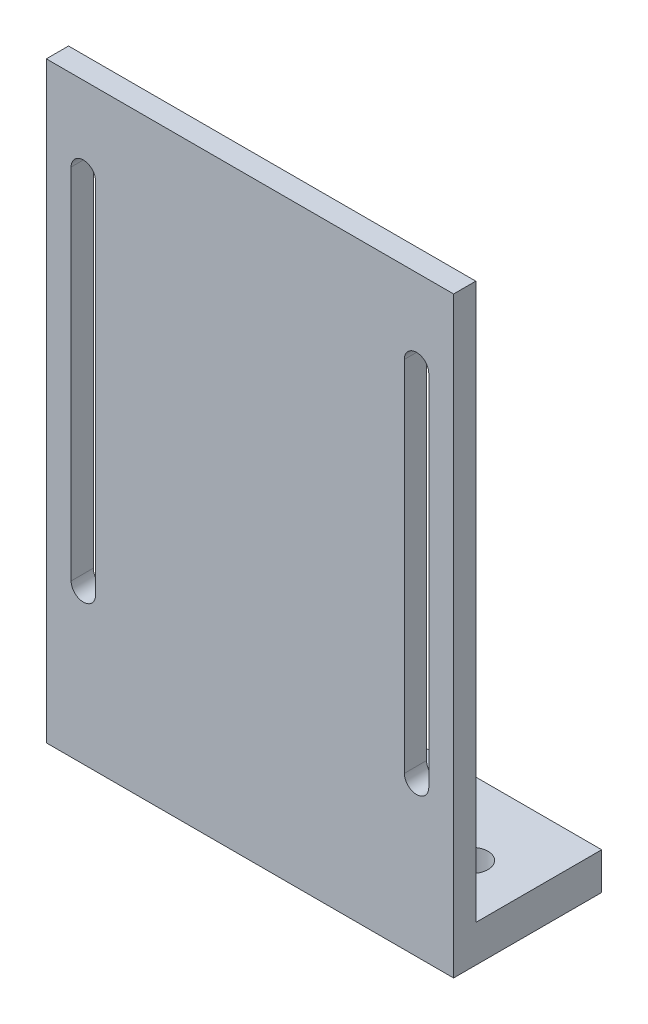
ISO-10303-21;
HEADER;
FILE_DESCRIPTION(('STEP AP214'),'2;1');
FILE_NAME('part.step','',(''),(''),'','','');
FILE_SCHEMA(('AUTOMOTIVE_DESIGN { 1 0 10303 214 1 1 1 1 }'));
ENDSEC;
DATA;
#1=APPLICATION_CONTEXT('core data for automotive mechanical design processes');
#2=APPLICATION_PROTOCOL_DEFINITION('international standard','automotive_design',2000,#1);
#3=PRODUCT_CONTEXT('',#1,'mechanical');
#4=PRODUCT('Part','Part','',(#3));
#5=PRODUCT_RELATED_PRODUCT_CATEGORY('part','',(#4));
#6=PRODUCT_DEFINITION_FORMATION('','',#4);
#7=PRODUCT_DEFINITION_CONTEXT('part definition',#1,'design');
#8=PRODUCT_DEFINITION('design','',#6,#7);
#9=PRODUCT_DEFINITION_SHAPE('','',#8);
#10=(LENGTH_UNIT() NAMED_UNIT(*) SI_UNIT(.MILLI.,.METRE.));
#11=(NAMED_UNIT(*) PLANE_ANGLE_UNIT() SI_UNIT($,.RADIAN.));
#12=(NAMED_UNIT(*) SI_UNIT($,.STERADIAN.) SOLID_ANGLE_UNIT());
#13=UNCERTAINTY_MEASURE_WITH_UNIT(LENGTH_MEASURE(1.E-05),#10,'distance_accuracy_value','');
#14=(GEOMETRIC_REPRESENTATION_CONTEXT(3) GLOBAL_UNCERTAINTY_ASSIGNED_CONTEXT((#13)) GLOBAL_UNIT_ASSIGNED_CONTEXT((#10,
#11,#12)) REPRESENTATION_CONTEXT('',''));
#15=CARTESIAN_POINT('',(0.,0.,0.));
#16=DIRECTION('',(0.,0.,1.));
#17=DIRECTION('',(1.,0.,0.));
#18=AXIS2_PLACEMENT_3D('',#15,#16,#17);
#19=CARTESIAN_POINT('',(0.,5.,0.));
#20=DIRECTION('',(0.,1.,0.));
#21=DIRECTION('',(0.,0.,1.));
#22=AXIS2_PLACEMENT_3D('',#19,#20,#21);
#23=PLANE('',#22);
#24=DIRECTION('',(-1.,0.,0.));
#25=VECTOR('',#24,1.);
#26=CARTESIAN_POINT('',(-27.5,5.,6.99999999999999));
#27=LINE('',#26,#25);
#28=CARTESIAN_POINT('',(27.5,5.,6.99999999999999));
#29=VERTEX_POINT('',#28);
#30=CARTESIAN_POINT('',(-27.5,5.,6.99999999999999));
#31=VERTEX_POINT('',#30);
#32=EDGE_CURVE('E203',#29,#31,#27,.T.);
#33=ORIENTED_EDGE('',*,*,#32,.F.);
#34=DIRECTION('',(0.,0.,-1.));
#35=VECTOR('',#34,1.);
#36=CARTESIAN_POINT('',(27.5,5.,-9.99999999999999));
#37=LINE('',#36,#35);
#38=CARTESIAN_POINT('',(27.5,5.,-9.99999999999999));
#39=VERTEX_POINT('',#38);
#40=EDGE_CURVE('E235',#29,#39,#37,.T.);
#41=ORIENTED_EDGE('',*,*,#40,.T.);
#42=DIRECTION('',(-1.,0.,0.));
#43=VECTOR('',#42,1.);
#44=CARTESIAN_POINT('',(-27.5,5.,-10.));
#45=LINE('',#44,#43);
#46=CARTESIAN_POINT('',(-27.5,5.,-10.));
#47=VERTEX_POINT('',#46);
#48=EDGE_CURVE('E237',#39,#47,#45,.T.);
#49=ORIENTED_EDGE('',*,*,#48,.T.);
#50=DIRECTION('',(0.,0.,1.));
#51=VECTOR('',#50,1.);
#52=CARTESIAN_POINT('',(-27.5,5.,-10.));
#53=LINE('',#52,#51);
#54=EDGE_CURVE('E240',#47,#31,#53,.T.);
#55=ORIENTED_EDGE('',*,*,#54,.T.);
#56=EDGE_LOOP('',(#33,#41,#49,#55));
#57=FACE_BOUND('',#56,.T.);
#58=CARTESIAN_POINT('',(-20.,5.,0.));
#59=DIRECTION('',(0.,1.,0.));
#60=DIRECTION('',(0.,0.,1.));
#61=AXIS2_PLACEMENT_3D('',#58,#59,#60);
#62=CIRCLE('',#61,2.15);
#63=CARTESIAN_POINT('',(-20.,5.,2.15));
#64=VERTEX_POINT('',#63);
#65=EDGE_CURVE('E229',#64,#64,#62,.T.);
#66=ORIENTED_EDGE('',*,*,#65,.F.);
#67=EDGE_LOOP('',(#66));
#68=FACE_BOUND('',#67,.T.);
#69=CARTESIAN_POINT('',(20.,5.,0.));
#70=DIRECTION('',(0.,1.,0.));
#71=DIRECTION('',(0.,0.,1.));
#72=AXIS2_PLACEMENT_3D('',#69,#70,#71);
#73=CIRCLE('',#72,2.15);
#74=CARTESIAN_POINT('',(20.,5.,2.15));
#75=VERTEX_POINT('',#74);
#76=EDGE_CURVE('E223',#75,#75,#73,.T.);
#77=ORIENTED_EDGE('',*,*,#76,.F.);
#78=EDGE_LOOP('',(#77));
#79=FACE_BOUND('',#78,.T.);
#80=ADVANCED_FACE('F33',(#57,#68,#79),#23,.T.);
#81=CARTESIAN_POINT('',(0.,0.,0.));
#82=DIRECTION('',(0.,1.,0.));
#83=DIRECTION('',(0.,0.,1.));
#84=AXIS2_PLACEMENT_3D('',#81,#82,#83);
#85=PLANE('',#84);
#86=DIRECTION('',(0.,0.,-1.));
#87=VECTOR('',#86,1.);
#88=CARTESIAN_POINT('',(27.5,0.,-9.99999999999999));
#89=LINE('',#88,#87);
#90=CARTESIAN_POINT('',(27.5,0.,9.99999999999999));
#91=VERTEX_POINT('',#90);
#92=CARTESIAN_POINT('',(27.5,0.,-9.99999999999999));
#93=VERTEX_POINT('',#92);
#94=EDGE_CURVE('E232',#91,#93,#89,.T.);
#95=ORIENTED_EDGE('',*,*,#94,.F.);
#96=DIRECTION('',(1.,0.,0.));
#97=VECTOR('',#96,1.);
#98=CARTESIAN_POINT('',(-27.5,0.,9.99999999999999));
#99=LINE('',#98,#97);
#100=CARTESIAN_POINT('',(-27.5,0.,9.99999999999999));
#101=VERTEX_POINT('',#100);
#102=EDGE_CURVE('E238',#101,#91,#99,.T.);
#103=ORIENTED_EDGE('',*,*,#102,.F.);
#104=DIRECTION('',(0.,0.,1.));
#105=VECTOR('',#104,1.);
#106=CARTESIAN_POINT('',(-27.5,0.,-10.));
#107=LINE('',#106,#105);
#108=CARTESIAN_POINT('',(-27.5,0.,-10.));
#109=VERTEX_POINT('',#108);
#110=EDGE_CURVE('E247',#109,#101,#107,.T.);
#111=ORIENTED_EDGE('',*,*,#110,.F.);
#112=DIRECTION('',(-1.,0.,0.));
#113=VECTOR('',#112,1.);
#114=CARTESIAN_POINT('',(-27.5,0.,-10.));
#115=LINE('',#114,#113);
#116=EDGE_CURVE('E245',#93,#109,#115,.T.);
#117=ORIENTED_EDGE('',*,*,#116,.F.);
#118=EDGE_LOOP('',(#95,#103,#111,#117));
#119=FACE_BOUND('',#118,.T.);
#120=CARTESIAN_POINT('',(-20.,0.,0.));
#121=DIRECTION('',(0.,1.,0.));
#122=DIRECTION('',(0.,0.,1.));
#123=AXIS2_PLACEMENT_3D('',#120,#121,#122);
#124=CIRCLE('',#123,2.15);
#125=CARTESIAN_POINT('',(-20.,0.,2.15));
#126=VERTEX_POINT('',#125);
#127=EDGE_CURVE('E226',#126,#126,#124,.T.);
#128=ORIENTED_EDGE('',*,*,#127,.T.);
#129=EDGE_LOOP('',(#128));
#130=FACE_BOUND('',#129,.T.);
#131=CARTESIAN_POINT('',(20.,0.,0.));
#132=DIRECTION('',(0.,1.,0.));
#133=DIRECTION('',(0.,0.,1.));
#134=AXIS2_PLACEMENT_3D('',#131,#132,#133);
#135=CIRCLE('',#134,2.15);
#136=CARTESIAN_POINT('',(20.,0.,2.15));
#137=VERTEX_POINT('',#136);
#138=EDGE_CURVE('E222',#137,#137,#135,.T.);
#139=ORIENTED_EDGE('',*,*,#138,.T.);
#140=EDGE_LOOP('',(#139));
#141=FACE_BOUND('',#140,.T.);
#142=ADVANCED_FACE('F265',(#119,#130,#141),#85,.F.);
#143=CARTESIAN_POINT('',(27.5,5.,-9.99999999999999));
#144=DIRECTION('',(-1.,0.,0.));
#145=DIRECTION('',(0.,0.,1.));
#146=AXIS2_PLACEMENT_3D('',#143,#144,#145);
#147=PLANE('',#146);
#148=ORIENTED_EDGE('',*,*,#94,.T.);
#149=DIRECTION('',(0.,-1.,0.));
#150=VECTOR('',#149,1.);
#151=CARTESIAN_POINT('',(27.5,5.,-9.99999999999999));
#152=LINE('',#151,#150);
#153=EDGE_CURVE('E11',#39,#93,#152,.T.);
#154=ORIENTED_EDGE('',*,*,#153,.F.);
#155=ORIENTED_EDGE('',*,*,#40,.F.);
#156=DIRECTION('',(0.,-1.,0.));
#157=VECTOR('',#156,1.);
#158=CARTESIAN_POINT('',(27.5,80.,6.99999999999999));
#159=LINE('',#158,#157);
#160=CARTESIAN_POINT('',(27.5,80.,6.99999999999999));
#161=VERTEX_POINT('',#160);
#162=EDGE_CURVE('E219',#161,#29,#159,.T.);
#163=ORIENTED_EDGE('',*,*,#162,.F.);
#164=DIRECTION('',(0.,0.,-1.));
#165=VECTOR('',#164,1.);
#166=CARTESIAN_POINT('',(27.5,80.,6.99999999999999));
#167=LINE('',#166,#165);
#168=CARTESIAN_POINT('',(27.5,80.,9.99999999999999));
#169=VERTEX_POINT('',#168);
#170=EDGE_CURVE('E210',#169,#161,#167,.T.);
#171=ORIENTED_EDGE('',*,*,#170,.F.);
#172=DIRECTION('',(0.,-1.,0.));
#173=VECTOR('',#172,1.);
#174=CARTESIAN_POINT('',(27.5,5.,9.99999999999999));
#175=LINE('',#174,#173);
#176=EDGE_CURVE('E242',#169,#91,#175,.T.);
#177=ORIENTED_EDGE('',*,*,#176,.T.);
#178=EDGE_LOOP('',(#148,#154,#155,#163,#171,#177));
#179=FACE_BOUND('',#178,.T.);
#180=ADVANCED_FACE('F35',(#179),#147,.F.);
#181=CARTESIAN_POINT('',(-27.5,5.,-10.));
#182=DIRECTION('',(0.,0.,1.));
#183=DIRECTION('',(1.,0.,0.));
#184=AXIS2_PLACEMENT_3D('',#181,#182,#183);
#185=PLANE('',#184);
#186=ORIENTED_EDGE('',*,*,#116,.T.);
#187=DIRECTION('',(0.,-1.,0.));
#188=VECTOR('',#187,1.);
#189=CARTESIAN_POINT('',(-27.5,5.,-10.));
#190=LINE('',#189,#188);
#191=EDGE_CURVE('E41',#47,#109,#190,.T.);
#192=ORIENTED_EDGE('',*,*,#191,.F.);
#193=ORIENTED_EDGE('',*,*,#48,.F.);
#194=ORIENTED_EDGE('',*,*,#153,.T.);
#195=EDGE_LOOP('',(#186,#192,#193,#194));
#196=FACE_BOUND('',#195,.T.);
#197=ADVANCED_FACE('F283',(#196),#185,.F.);
#198=CARTESIAN_POINT('',(-27.5,5.,-10.));
#199=DIRECTION('',(1.,0.,0.));
#200=DIRECTION('',(0.,0.,-1.));
#201=AXIS2_PLACEMENT_3D('',#198,#199,#200);
#202=PLANE('',#201);
#203=ORIENTED_EDGE('',*,*,#110,.T.);
#204=DIRECTION('',(0.,-1.,0.));
#205=VECTOR('',#204,1.);
#206=CARTESIAN_POINT('',(-27.5,5.,9.99999999999999));
#207=LINE('',#206,#205);
#208=CARTESIAN_POINT('',(-27.5,80.,9.99999999999999));
#209=VERTEX_POINT('',#208);
#210=EDGE_CURVE('E252',#209,#101,#207,.T.);
#211=ORIENTED_EDGE('',*,*,#210,.F.);
#212=DIRECTION('',(0.,0.,1.));
#213=VECTOR('',#212,1.);
#214=CARTESIAN_POINT('',(-27.5,80.,6.99999999999999));
#215=LINE('',#214,#213);
#216=CARTESIAN_POINT('',(-27.5,80.,6.99999999999999));
#217=VERTEX_POINT('',#216);
#218=EDGE_CURVE('E204',#217,#209,#215,.T.);
#219=ORIENTED_EDGE('',*,*,#218,.F.);
#220=DIRECTION('',(0.,-1.,0.));
#221=VECTOR('',#220,1.);
#222=CARTESIAN_POINT('',(-27.5,80.,6.99999999999999));
#223=LINE('',#222,#221);
#224=EDGE_CURVE('E214',#217,#31,#223,.T.);
#225=ORIENTED_EDGE('',*,*,#224,.T.);
#226=ORIENTED_EDGE('',*,*,#54,.F.);
#227=ORIENTED_EDGE('',*,*,#191,.T.);
#228=EDGE_LOOP('',(#203,#211,#219,#225,#226,#227));
#229=FACE_BOUND('',#228,.T.);
#230=ADVANCED_FACE('F259',(#229),#202,.F.);
#231=CARTESIAN_POINT('',(-27.5,5.,9.99999999999999));
#232=DIRECTION('',(0.,0.,-1.));
#233=DIRECTION('',(-1.,0.,0.));
#234=AXIS2_PLACEMENT_3D('',#231,#232,#233);
#235=PLANE('',#234);
#236=DIRECTION('',(0.,1.,0.));
#237=VECTOR('',#236,1.);
#238=CARTESIAN_POINT('',(-24.15,5.,9.99999999999999));
#239=LINE('',#238,#237);
#240=CARTESIAN_POINT('',(-24.15,20.6088620318078,9.99999999999999));
#241=VERTEX_POINT('',#240);
#242=CARTESIAN_POINT('',(-24.15,69.0222855755683,9.99999999999999));
#243=VERTEX_POINT('',#242);
#244=EDGE_CURVE('E165',#241,#243,#239,.T.);
#245=ORIENTED_EDGE('',*,*,#244,.T.);
#246=CARTESIAN_POINT('',(-22.5,69.0222855755683,9.99999999999999));
#247=DIRECTION('',(0.,0.,-1.));
#248=DIRECTION('',(-1.,0.,0.));
#249=AXIS2_PLACEMENT_3D('',#246,#247,#248);
#250=CIRCLE('',#249,1.65);
#251=CARTESIAN_POINT('',(-20.85,69.0222855755683,9.99999999999999));
#252=VERTEX_POINT('',#251);
#253=EDGE_CURVE('E168',#243,#252,#250,.T.);
#254=ORIENTED_EDGE('',*,*,#253,.T.);
#255=DIRECTION('',(0.,-1.,0.));
#256=VECTOR('',#255,1.);
#257=CARTESIAN_POINT('',(-20.85,5.,9.99999999999999));
#258=LINE('',#257,#256);
#259=CARTESIAN_POINT('',(-20.85,20.6088620318078,9.99999999999999));
#260=VERTEX_POINT('',#259);
#261=EDGE_CURVE('E160',#252,#260,#258,.T.);
#262=ORIENTED_EDGE('',*,*,#261,.T.);
#263=CARTESIAN_POINT('',(-22.5,20.6088620318078,9.99999999999999));
#264=DIRECTION('',(0.,0.,-1.));
#265=DIRECTION('',(-1.,0.,0.));
#266=AXIS2_PLACEMENT_3D('',#263,#264,#265);
#267=CIRCLE('',#266,1.65);
#268=EDGE_CURVE('E140',#260,#241,#267,.T.);
#269=ORIENTED_EDGE('',*,*,#268,.T.);
#270=EDGE_LOOP('',(#245,#254,#262,#269));
#271=FACE_BOUND('',#270,.T.);
#272=DIRECTION('',(0.,1.,0.));
#273=VECTOR('',#272,1.);
#274=CARTESIAN_POINT('',(20.85,4.99999999999999,9.99999999999999));
#275=LINE('',#274,#273);
#276=CARTESIAN_POINT('',(20.85,20.6088620318078,9.99999999999999));
#277=VERTEX_POINT('',#276);
#278=CARTESIAN_POINT('',(20.85,69.0222855755683,9.99999999999999));
#279=VERTEX_POINT('',#278);
#280=EDGE_CURVE('E197',#277,#279,#275,.T.);
#281=ORIENTED_EDGE('',*,*,#280,.T.);
#282=CARTESIAN_POINT('',(22.5,69.0222855755683,9.99999999999999));
#283=DIRECTION('',(0.,0.,-1.));
#284=DIRECTION('',(-1.,0.,0.));
#285=AXIS2_PLACEMENT_3D('',#282,#283,#284);
#286=CIRCLE('',#285,1.65);
#287=CARTESIAN_POINT('',(24.15,69.0222855755683,9.99999999999999));
#288=VERTEX_POINT('',#287);
#289=EDGE_CURVE('E200',#279,#288,#286,.T.);
#290=ORIENTED_EDGE('',*,*,#289,.T.);
#291=DIRECTION('',(0.,-1.,0.));
#292=VECTOR('',#291,1.);
#293=CARTESIAN_POINT('',(24.15,5.,9.99999999999999));
#294=LINE('',#293,#292);
#295=CARTESIAN_POINT('',(24.15,20.6088620318078,9.99999999999999));
#296=VERTEX_POINT('',#295);
#297=EDGE_CURVE('E185',#288,#296,#294,.T.);
#298=ORIENTED_EDGE('',*,*,#297,.T.);
#299=CARTESIAN_POINT('',(22.5,20.6088620318078,9.99999999999999));
#300=DIRECTION('',(0.,0.,-1.));
#301=DIRECTION('',(-1.,0.,0.));
#302=AXIS2_PLACEMENT_3D('',#299,#300,#301);
#303=CIRCLE('',#302,1.65);
#304=EDGE_CURVE('E194',#296,#277,#303,.T.);
#305=ORIENTED_EDGE('',*,*,#304,.T.);
#306=EDGE_LOOP('',(#281,#290,#298,#305));
#307=FACE_BOUND('',#306,.T.);
#308=ORIENTED_EDGE('',*,*,#102,.T.);
#309=ORIENTED_EDGE('',*,*,#176,.F.);
#310=DIRECTION('',(1.,0.,0.));
#311=VECTOR('',#310,1.);
#312=CARTESIAN_POINT('',(-27.5,80.,9.99999999999999));
#313=LINE('',#312,#311);
#314=EDGE_CURVE('E207',#209,#169,#313,.T.);
#315=ORIENTED_EDGE('',*,*,#314,.F.);
#316=ORIENTED_EDGE('',*,*,#210,.T.);
#317=EDGE_LOOP('',(#308,#309,#315,#316));
#318=FACE_BOUND('',#317,.T.);
#319=ADVANCED_FACE('F268',(#271,#307,#318),#235,.F.);
#320=CARTESIAN_POINT('',(-20.,5.,0.));
#321=DIRECTION('',(0.,-1.,0.));
#322=DIRECTION('',(0.,0.,-1.));
#323=AXIS2_PLACEMENT_3D('',#320,#321,#322);
#324=CYLINDRICAL_SURFACE('',#323,2.15);
#325=ORIENTED_EDGE('',*,*,#65,.T.);
#326=EDGE_LOOP('',(#325));
#327=FACE_BOUND('',#326,.T.);
#328=ORIENTED_EDGE('',*,*,#127,.F.);
#329=EDGE_LOOP('',(#328));
#330=FACE_BOUND('',#329,.T.);
#331=ADVANCED_FACE('F297',(#327,#330),#324,.F.);
#332=CARTESIAN_POINT('',(20.,5.,0.));
#333=DIRECTION('',(0.,-1.,0.));
#334=DIRECTION('',(0.,0.,-1.));
#335=AXIS2_PLACEMENT_3D('',#332,#333,#334);
#336=CYLINDRICAL_SURFACE('',#335,2.15);
#337=ORIENTED_EDGE('',*,*,#76,.T.);
#338=EDGE_LOOP('',(#337));
#339=FACE_BOUND('',#338,.T.);
#340=ORIENTED_EDGE('',*,*,#138,.F.);
#341=EDGE_LOOP('',(#340));
#342=FACE_BOUND('',#341,.T.);
#343=ADVANCED_FACE('F305',(#339,#342),#336,.F.);
#344=CARTESIAN_POINT('',(-27.5,80.,6.99999999999999));
#345=DIRECTION('',(0.,0.,1.));
#346=DIRECTION('',(1.,0.,0.));
#347=AXIS2_PLACEMENT_3D('',#344,#345,#346);
#348=PLANE('',#347);
#349=DIRECTION('',(0.,-1.,0.));
#350=VECTOR('',#349,1.);
#351=CARTESIAN_POINT('',(-20.85,69.0222855755683,6.99999999999999));
#352=LINE('',#351,#350);
#353=CARTESIAN_POINT('',(-20.85,69.0222855755683,6.99999999999999));
#354=VERTEX_POINT('',#353);
#355=CARTESIAN_POINT('',(-20.85,20.6088620318078,6.99999999999999));
#356=VERTEX_POINT('',#355);
#357=EDGE_CURVE('E146',#354,#356,#352,.T.);
#358=ORIENTED_EDGE('',*,*,#357,.F.);
#359=CARTESIAN_POINT('',(-22.5,69.0222855755683,6.99999999999999));
#360=DIRECTION('',(0.,0.,-1.));
#361=DIRECTION('',(1.,0.,0.));
#362=AXIS2_PLACEMENT_3D('',#359,#360,#361);
#363=CIRCLE('',#362,1.65);
#364=CARTESIAN_POINT('',(-24.15,69.0222855755683,6.99999999999999));
#365=VERTEX_POINT('',#364);
#366=EDGE_CURVE('E56',#365,#354,#363,.T.);
#367=ORIENTED_EDGE('',*,*,#366,.F.);
#368=DIRECTION('',(0.,1.,0.));
#369=VECTOR('',#368,1.);
#370=CARTESIAN_POINT('',(-24.15,69.0222855755683,6.99999999999999));
#371=LINE('',#370,#369);
#372=CARTESIAN_POINT('',(-24.15,20.6088620318078,6.99999999999999));
#373=VERTEX_POINT('',#372);
#374=EDGE_CURVE('E153',#373,#365,#371,.T.);
#375=ORIENTED_EDGE('',*,*,#374,.F.);
#376=CARTESIAN_POINT('',(-22.5,20.6088620318078,6.99999999999999));
#377=DIRECTION('',(0.,0.,-1.));
#378=DIRECTION('',(1.,0.,0.));
#379=AXIS2_PLACEMENT_3D('',#376,#377,#378);
#380=CIRCLE('',#379,1.65);
#381=EDGE_CURVE('E137',#356,#373,#380,.T.);
#382=ORIENTED_EDGE('',*,*,#381,.F.);
#383=EDGE_LOOP('',(#358,#367,#375,#382));
#384=FACE_BOUND('',#383,.T.);
#385=DIRECTION('',(0.,-1.,0.));
#386=VECTOR('',#385,1.);
#387=CARTESIAN_POINT('',(24.15,69.0222855755683,6.99999999999999));
#388=LINE('',#387,#386);
#389=CARTESIAN_POINT('',(24.15,69.0222855755683,6.99999999999999));
#390=VERTEX_POINT('',#389);
#391=CARTESIAN_POINT('',(24.15,20.6088620318078,6.99999999999999));
#392=VERTEX_POINT('',#391);
#393=EDGE_CURVE('E173',#390,#392,#388,.T.);
#394=ORIENTED_EDGE('',*,*,#393,.F.);
#395=CARTESIAN_POINT('',(22.5,69.0222855755683,6.99999999999999));
#396=DIRECTION('',(0.,0.,-1.));
#397=DIRECTION('',(-1.,0.,0.));
#398=AXIS2_PLACEMENT_3D('',#395,#396,#397);
#399=CIRCLE('',#398,1.65);
#400=CARTESIAN_POINT('',(20.85,69.0222855755683,6.99999999999999));
#401=VERTEX_POINT('',#400);
#402=EDGE_CURVE('E171',#401,#390,#399,.T.);
#403=ORIENTED_EDGE('',*,*,#402,.F.);
#404=DIRECTION('',(0.,1.,0.));
#405=VECTOR('',#404,1.);
#406=CARTESIAN_POINT('',(20.85,69.0222855755683,6.99999999999999));
#407=LINE('',#406,#405);
#408=CARTESIAN_POINT('',(20.85,20.6088620318078,6.99999999999999));
#409=VERTEX_POINT('',#408);
#410=EDGE_CURVE('E179',#409,#401,#407,.T.);
#411=ORIENTED_EDGE('',*,*,#410,.F.);
#412=CARTESIAN_POINT('',(22.5,20.6088620318078,6.99999999999999));
#413=DIRECTION('',(0.,0.,-1.));
#414=DIRECTION('',(-1.,0.,0.));
#415=AXIS2_PLACEMENT_3D('',#412,#413,#414);
#416=CIRCLE('',#415,1.65);
#417=EDGE_CURVE('E176',#392,#409,#416,.T.);
#418=ORIENTED_EDGE('',*,*,#417,.F.);
#419=EDGE_LOOP('',(#394,#403,#411,#418));
#420=FACE_BOUND('',#419,.T.);
#421=ORIENTED_EDGE('',*,*,#32,.T.);
#422=ORIENTED_EDGE('',*,*,#224,.F.);
#423=DIRECTION('',(-1.,0.,0.));
#424=VECTOR('',#423,1.);
#425=CARTESIAN_POINT('',(-27.5,80.,6.99999999999999));
#426=LINE('',#425,#424);
#427=EDGE_CURVE('E212',#161,#217,#426,.T.);
#428=ORIENTED_EDGE('',*,*,#427,.F.);
#429=ORIENTED_EDGE('',*,*,#162,.T.);
#430=EDGE_LOOP('',(#421,#422,#428,#429));
#431=FACE_BOUND('',#430,.T.);
#432=ADVANCED_FACE('F150',(#384,#420,#431),#348,.F.);
#433=CARTESIAN_POINT('',(0.,80.,0.));
#434=DIRECTION('',(0.,1.,0.));
#435=DIRECTION('',(0.,0.,1.));
#436=AXIS2_PLACEMENT_3D('',#433,#434,#435);
#437=PLANE('',#436);
#438=ORIENTED_EDGE('',*,*,#218,.T.);
#439=ORIENTED_EDGE('',*,*,#314,.T.);
#440=ORIENTED_EDGE('',*,*,#170,.T.);
#441=ORIENTED_EDGE('',*,*,#427,.T.);
#442=EDGE_LOOP('',(#438,#439,#440,#441));
#443=FACE_BOUND('',#442,.T.);
#444=ADVANCED_FACE('F277',(#443),#437,.T.);
#445=CARTESIAN_POINT('',(22.5,69.0222855755683,82.));
#446=DIRECTION('',(0.,0.,-1.));
#447=DIRECTION('',(-1.,0.,0.));
#448=AXIS2_PLACEMENT_3D('',#445,#446,#447);
#449=CYLINDRICAL_SURFACE('',#448,1.65);
#450=DIRECTION('',(0.,0.,-1.));
#451=VECTOR('',#450,1.);
#452=CARTESIAN_POINT('',(20.85,69.0222855755683,82.));
#453=LINE('',#452,#451);
#454=EDGE_CURVE('E183',#279,#401,#453,.T.);
#455=ORIENTED_EDGE('',*,*,#454,.T.);
#456=ORIENTED_EDGE('',*,*,#402,.T.);
#457=DIRECTION('',(0.,0.,-1.));
#458=VECTOR('',#457,1.);
#459=CARTESIAN_POINT('',(24.15,69.0222855755683,82.));
#460=LINE('',#459,#458);
#461=EDGE_CURVE('E182',#288,#390,#460,.T.);
#462=ORIENTED_EDGE('',*,*,#461,.F.);
#463=ORIENTED_EDGE('',*,*,#289,.F.);
#464=EDGE_LOOP('',(#455,#456,#462,#463));
#465=FACE_BOUND('',#464,.T.);
#466=ADVANCED_FACE('F321',(#465),#449,.F.);
#467=CARTESIAN_POINT('',(20.85,69.0222855755683,82.));
#468=DIRECTION('',(-1.,0.,0.));
#469=DIRECTION('',(0.,-1.,0.));
#470=AXIS2_PLACEMENT_3D('',#467,#468,#469);
#471=PLANE('',#470);
#472=DIRECTION('',(0.,0.,-1.));
#473=VECTOR('',#472,1.);
#474=CARTESIAN_POINT('',(20.85,20.6088620318078,82.));
#475=LINE('',#474,#473);
#476=EDGE_CURVE('E186',#277,#409,#475,.T.);
#477=ORIENTED_EDGE('',*,*,#476,.T.);
#478=ORIENTED_EDGE('',*,*,#410,.T.);
#479=ORIENTED_EDGE('',*,*,#454,.F.);
#480=ORIENTED_EDGE('',*,*,#280,.F.);
#481=EDGE_LOOP('',(#477,#478,#479,#480));
#482=FACE_BOUND('',#481,.T.);
#483=ADVANCED_FACE('F312',(#482),#471,.F.);
#484=CARTESIAN_POINT('',(22.5,20.6088620318078,82.));
#485=DIRECTION('',(0.,0.,-1.));
#486=DIRECTION('',(-1.,0.,0.));
#487=AXIS2_PLACEMENT_3D('',#484,#485,#486);
#488=CYLINDRICAL_SURFACE('',#487,1.65);
#489=DIRECTION('',(0.,0.,-1.));
#490=VECTOR('',#489,1.);
#491=CARTESIAN_POINT('',(24.15,20.6088620318078,82.));
#492=LINE('',#491,#490);
#493=EDGE_CURVE('E188',#296,#392,#492,.T.);
#494=ORIENTED_EDGE('',*,*,#493,.T.);
#495=ORIENTED_EDGE('',*,*,#417,.T.);
#496=ORIENTED_EDGE('',*,*,#476,.F.);
#497=ORIENTED_EDGE('',*,*,#304,.F.);
#498=EDGE_LOOP('',(#494,#495,#496,#497));
#499=FACE_BOUND('',#498,.T.);
#500=ADVANCED_FACE('F314',(#499),#488,.F.);
#501=CARTESIAN_POINT('',(24.15,69.0222855755683,82.));
#502=DIRECTION('',(1.,0.,0.));
#503=DIRECTION('',(0.,0.,-1.));
#504=AXIS2_PLACEMENT_3D('',#501,#502,#503);
#505=PLANE('',#504);
#506=ORIENTED_EDGE('',*,*,#461,.T.);
#507=ORIENTED_EDGE('',*,*,#393,.T.);
#508=ORIENTED_EDGE('',*,*,#493,.F.);
#509=ORIENTED_EDGE('',*,*,#297,.F.);
#510=EDGE_LOOP('',(#506,#507,#508,#509));
#511=FACE_BOUND('',#510,.T.);
#512=ADVANCED_FACE('F323',(#511),#505,.F.);
#513=CARTESIAN_POINT('',(-22.5,69.0222855755683,82.));
#514=DIRECTION('',(0.,0.,-1.));
#515=DIRECTION('',(-1.,0.,0.));
#516=AXIS2_PLACEMENT_3D('',#513,#514,#515);
#517=CYLINDRICAL_SURFACE('',#516,1.65);
#518=DIRECTION('',(0.,0.,-1.));
#519=VECTOR('',#518,1.);
#520=CARTESIAN_POINT('',(-24.15,69.0222855755683,82.));
#521=LINE('',#520,#519);
#522=EDGE_CURVE('E158',#243,#365,#521,.T.);
#523=ORIENTED_EDGE('',*,*,#522,.T.);
#524=ORIENTED_EDGE('',*,*,#366,.T.);
#525=DIRECTION('',(0.,0.,-1.));
#526=VECTOR('',#525,1.);
#527=CARTESIAN_POINT('',(-20.85,69.0222855755683,82.));
#528=LINE('',#527,#526);
#529=EDGE_CURVE('E143',#252,#354,#528,.T.);
#530=ORIENTED_EDGE('',*,*,#529,.F.);
#531=ORIENTED_EDGE('',*,*,#253,.F.);
#532=EDGE_LOOP('',(#523,#524,#530,#531));
#533=FACE_BOUND('',#532,.T.);
#534=ADVANCED_FACE('F325',(#533),#517,.F.);
#535=CARTESIAN_POINT('',(-24.15,69.0222855755683,82.));
#536=DIRECTION('',(-1.,0.,0.));
#537=DIRECTION('',(0.,0.,1.));
#538=AXIS2_PLACEMENT_3D('',#535,#536,#537);
#539=PLANE('',#538);
#540=DIRECTION('',(0.,0.,-1.));
#541=VECTOR('',#540,1.);
#542=CARTESIAN_POINT('',(-24.15,20.6088620318078,82.));
#543=LINE('',#542,#541);
#544=EDGE_CURVE('E142',#241,#373,#543,.T.);
#545=ORIENTED_EDGE('',*,*,#544,.T.);
#546=ORIENTED_EDGE('',*,*,#374,.T.);
#547=ORIENTED_EDGE('',*,*,#522,.F.);
#548=ORIENTED_EDGE('',*,*,#244,.F.);
#549=EDGE_LOOP('',(#545,#546,#547,#548));
#550=FACE_BOUND('',#549,.T.);
#551=ADVANCED_FACE('F331',(#550),#539,.F.);
#552=CARTESIAN_POINT('',(-22.5,20.6088620318078,82.));
#553=DIRECTION('',(0.,0.,-1.));
#554=DIRECTION('',(-1.,0.,0.));
#555=AXIS2_PLACEMENT_3D('',#552,#553,#554);
#556=CYLINDRICAL_SURFACE('',#555,1.65);
#557=DIRECTION('',(0.,0.,-1.));
#558=VECTOR('',#557,1.);
#559=CARTESIAN_POINT('',(-20.85,20.6088620318078,82.));
#560=LINE('',#559,#558);
#561=EDGE_CURVE('E48',#260,#356,#560,.T.);
#562=ORIENTED_EDGE('',*,*,#561,.T.);
#563=ORIENTED_EDGE('',*,*,#381,.T.);
#564=ORIENTED_EDGE('',*,*,#544,.F.);
#565=ORIENTED_EDGE('',*,*,#268,.F.);
#566=EDGE_LOOP('',(#562,#563,#564,#565));
#567=FACE_BOUND('',#566,.T.);
#568=ADVANCED_FACE('F134',(#567),#556,.F.);
#569=CARTESIAN_POINT('',(-20.85,69.0222855755683,82.));
#570=DIRECTION('',(1.,0.,0.));
#571=DIRECTION('',(0.,1.,0.));
#572=AXIS2_PLACEMENT_3D('',#569,#570,#571);
#573=PLANE('',#572);
#574=ORIENTED_EDGE('',*,*,#529,.T.);
#575=ORIENTED_EDGE('',*,*,#357,.T.);
#576=ORIENTED_EDGE('',*,*,#561,.F.);
#577=ORIENTED_EDGE('',*,*,#261,.F.);
#578=EDGE_LOOP('',(#574,#575,#576,#577));
#579=FACE_BOUND('',#578,.T.);
#580=ADVANCED_FACE('F147',(#579),#573,.F.);
#581=CLOSED_SHELL('',(#80,#142,#180,#197,#230,#319,#331,#343,#432,#444,#466,#483,#500,#512,#534,
#551,#568,#580));
#582=MANIFOLD_SOLID_BREP('B2',#581);
#583=ADVANCED_BREP_SHAPE_REPRESENTATION('',(#18,#582),#14);
#584=SHAPE_DEFINITION_REPRESENTATION(#9,#583);
ENDSEC;
END-ISO-10303-21;
